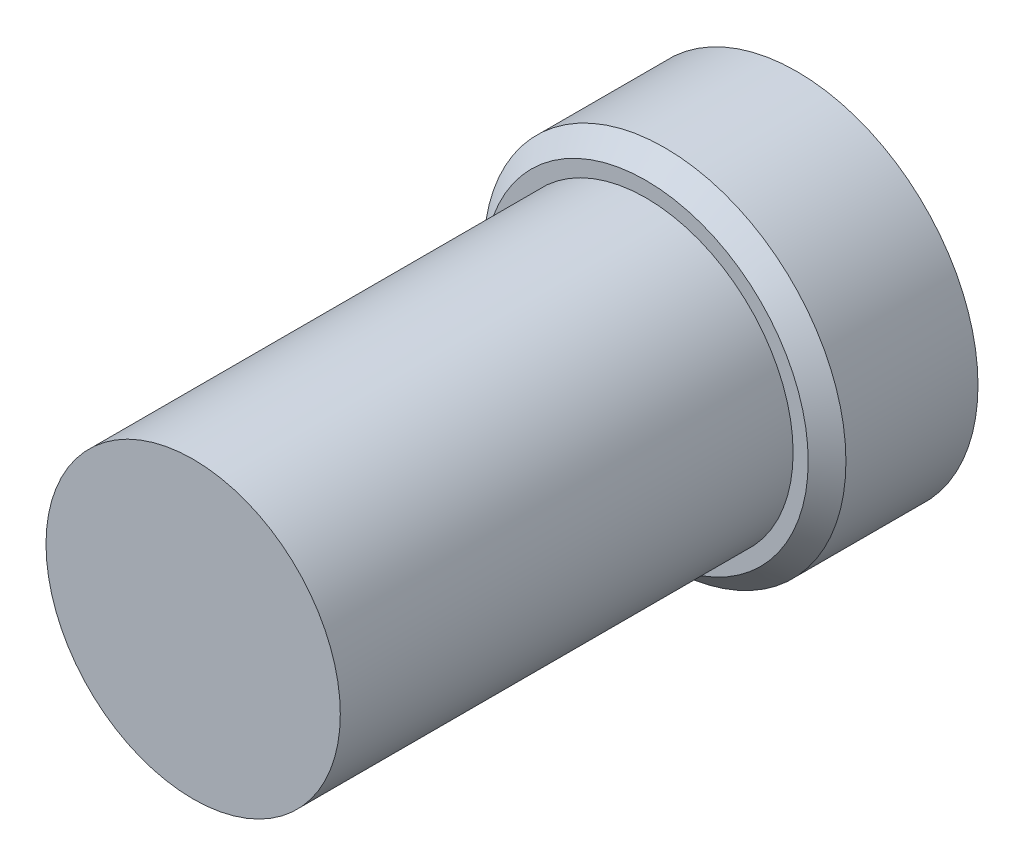
ISO-10303-21;
HEADER;
FILE_DESCRIPTION(('STEP AP214'),'2;1');
FILE_NAME('part.step','',(''),(''),'','','');
FILE_SCHEMA(('AUTOMOTIVE_DESIGN { 1 0 10303 214 1 1 1 1 }'));
ENDSEC;
DATA;
#1=APPLICATION_CONTEXT('core data for automotive mechanical design processes');
#2=APPLICATION_PROTOCOL_DEFINITION('international standard','automotive_design',2000,#1);
#3=PRODUCT_CONTEXT('',#1,'mechanical');
#4=PRODUCT('Part','Part','',(#3));
#5=PRODUCT_RELATED_PRODUCT_CATEGORY('part','',(#4));
#6=PRODUCT_DEFINITION_FORMATION('','',#4);
#7=PRODUCT_DEFINITION_CONTEXT('part definition',#1,'design');
#8=PRODUCT_DEFINITION('design','',#6,#7);
#9=PRODUCT_DEFINITION_SHAPE('','',#8);
#10=(LENGTH_UNIT() NAMED_UNIT(*) SI_UNIT(.MILLI.,.METRE.));
#11=(NAMED_UNIT(*) PLANE_ANGLE_UNIT() SI_UNIT($,.RADIAN.));
#12=(NAMED_UNIT(*) SI_UNIT($,.STERADIAN.) SOLID_ANGLE_UNIT());
#13=UNCERTAINTY_MEASURE_WITH_UNIT(LENGTH_MEASURE(1.E-05),#10,'distance_accuracy_value','');
#14=(GEOMETRIC_REPRESENTATION_CONTEXT(3) GLOBAL_UNCERTAINTY_ASSIGNED_CONTEXT((#13)) GLOBAL_UNIT_ASSIGNED_CONTEXT((#10,
#11,#12)) REPRESENTATION_CONTEXT('',''));
#15=CARTESIAN_POINT('',(0.,0.,0.));
#16=DIRECTION('',(0.,0.,1.));
#17=DIRECTION('',(1.,0.,0.));
#18=AXIS2_PLACEMENT_3D('',#15,#16,#17);
#19=CARTESIAN_POINT('',(0.,0.,2.));
#20=DIRECTION('',(0.,0.,1.));
#21=DIRECTION('',(1.,0.,0.));
#22=AXIS2_PLACEMENT_3D('',#19,#20,#21);
#23=PLANE('',#22);
#24=CARTESIAN_POINT('',(0.,0.,2.));
#25=DIRECTION('',(0.,0.,1.));
#26=DIRECTION('',(1.,0.,0.));
#27=AXIS2_PLACEMENT_3D('',#24,#25,#26);
#28=CIRCLE('',#27,2.15);
#29=CARTESIAN_POINT('',(2.15,0.,2.));
#30=VERTEX_POINT('',#29);
#31=EDGE_CURVE('E42',#30,#30,#28,.T.);
#32=ORIENTED_EDGE('',*,*,#31,.T.);
#33=EDGE_LOOP('',(#32));
#34=FACE_BOUND('',#33,.T.);
#35=CARTESIAN_POINT('',(0.,0.,2.));
#36=DIRECTION('',(0.,0.,1.));
#37=DIRECTION('',(1.,0.,0.));
#38=AXIS2_PLACEMENT_3D('',#35,#36,#37);
#39=CIRCLE('',#38,1.95);
#40=CARTESIAN_POINT('',(1.95,0.,2.));
#41=VERTEX_POINT('',#40);
#42=EDGE_CURVE('E53',#41,#41,#39,.T.);
#43=ORIENTED_EDGE('',*,*,#42,.F.);
#44=EDGE_LOOP('',(#43));
#45=FACE_BOUND('',#44,.T.);
#46=ADVANCED_FACE('F35',(#34,#45),#23,.T.);
#47=CARTESIAN_POINT('',(0.,0.,2.));
#48=DIRECTION('',(0.,0.,-1.));
#49=DIRECTION('',(-1.,0.,0.));
#50=AXIS2_PLACEMENT_3D('',#47,#48,#49);
#51=CYLINDRICAL_SURFACE('',#50,2.4);
#52=CARTESIAN_POINT('',(0.,0.,1.75));
#53=DIRECTION('',(0.,0.,1.));
#54=DIRECTION('',(1.,0.,0.));
#55=AXIS2_PLACEMENT_3D('',#52,#53,#54);
#56=CIRCLE('',#55,2.4);
#57=CARTESIAN_POINT('',(2.4,0.,1.75));
#58=VERTEX_POINT('',#57);
#59=EDGE_CURVE('E10',#58,#58,#56,.F.);
#60=ORIENTED_EDGE('',*,*,#59,.T.);
#61=EDGE_LOOP('',(#60));
#62=FACE_BOUND('',#61,.T.);
#63=CARTESIAN_POINT('',(0.,0.,0.));
#64=DIRECTION('',(0.,0.,1.));
#65=DIRECTION('',(1.,0.,0.));
#66=AXIS2_PLACEMENT_3D('',#63,#64,#65);
#67=CIRCLE('',#66,2.4);
#68=CARTESIAN_POINT('',(2.4,0.,0.));
#69=VERTEX_POINT('',#68);
#70=EDGE_CURVE('E46',#69,#69,#67,.T.);
#71=ORIENTED_EDGE('',*,*,#70,.T.);
#72=EDGE_LOOP('',(#71));
#73=FACE_BOUND('',#72,.T.);
#74=ADVANCED_FACE('F69',(#62,#73),#51,.T.);
#75=CARTESIAN_POINT('',(0.,0.,0.));
#76=DIRECTION('',(0.,0.,1.));
#77=DIRECTION('',(1.,0.,0.));
#78=AXIS2_PLACEMENT_3D('',#75,#76,#77);
#79=PLANE('',#78);
#80=ORIENTED_EDGE('',*,*,#70,.F.);
#81=EDGE_LOOP('',(#80));
#82=FACE_BOUND('',#81,.T.);
#83=ADVANCED_FACE('F64',(#82),#79,.F.);
#84=CARTESIAN_POINT('',(0.,0.,8.));
#85=DIRECTION('',(0.,0.,-1.));
#86=DIRECTION('',(-1.,0.,0.));
#87=AXIS2_PLACEMENT_3D('',#84,#85,#86);
#88=CYLINDRICAL_SURFACE('',#87,1.95);
#89=CARTESIAN_POINT('',(0.,0.,8.));
#90=DIRECTION('',(0.,0.,1.));
#91=DIRECTION('',(1.,0.,0.));
#92=AXIS2_PLACEMENT_3D('',#89,#90,#91);
#93=CIRCLE('',#92,1.95);
#94=CARTESIAN_POINT('',(1.95,0.,8.));
#95=VERTEX_POINT('',#94);
#96=EDGE_CURVE('E50',#95,#95,#93,.T.);
#97=ORIENTED_EDGE('',*,*,#96,.F.);
#98=EDGE_LOOP('',(#97));
#99=FACE_BOUND('',#98,.T.);
#100=ORIENTED_EDGE('',*,*,#42,.T.);
#101=EDGE_LOOP('',(#100));
#102=FACE_BOUND('',#101,.T.);
#103=ADVANCED_FACE('F61',(#99,#102),#88,.T.);
#104=CARTESIAN_POINT('',(0.,0.,8.));
#105=DIRECTION('',(0.,0.,1.));
#106=DIRECTION('',(1.,0.,0.));
#107=AXIS2_PLACEMENT_3D('',#104,#105,#106);
#108=PLANE('',#107);
#109=ORIENTED_EDGE('',*,*,#96,.T.);
#110=EDGE_LOOP('',(#109));
#111=FACE_BOUND('',#110,.T.);
#112=ADVANCED_FACE('F59',(#111),#108,.T.);
#113=CARTESIAN_POINT('',(0.,0.,2.));
#114=DIRECTION('',(0.,0.,-1.));
#115=DIRECTION('',(-1.,0.,0.));
#116=AXIS2_PLACEMENT_3D('',#113,#114,#115);
#117=CONICAL_SURFACE('',#116,2.15,0.785398163397449);
#118=ORIENTED_EDGE('',*,*,#59,.F.);
#119=EDGE_LOOP('',(#118));
#120=FACE_BOUND('',#119,.T.);
#121=ORIENTED_EDGE('',*,*,#31,.F.);
#122=EDGE_LOOP('',(#121));
#123=FACE_BOUND('',#122,.T.);
#124=ADVANCED_FACE('F37',(#120,#123),#117,.T.);
#125=CLOSED_SHELL('',(#46,#74,#83,#103,#112,#124));
#126=MANIFOLD_SOLID_BREP('B2',#125);
#127=ADVANCED_BREP_SHAPE_REPRESENTATION('',(#18,#126),#14);
#128=SHAPE_DEFINITION_REPRESENTATION(#9,#127);
ENDSEC;
END-ISO-10303-21;
